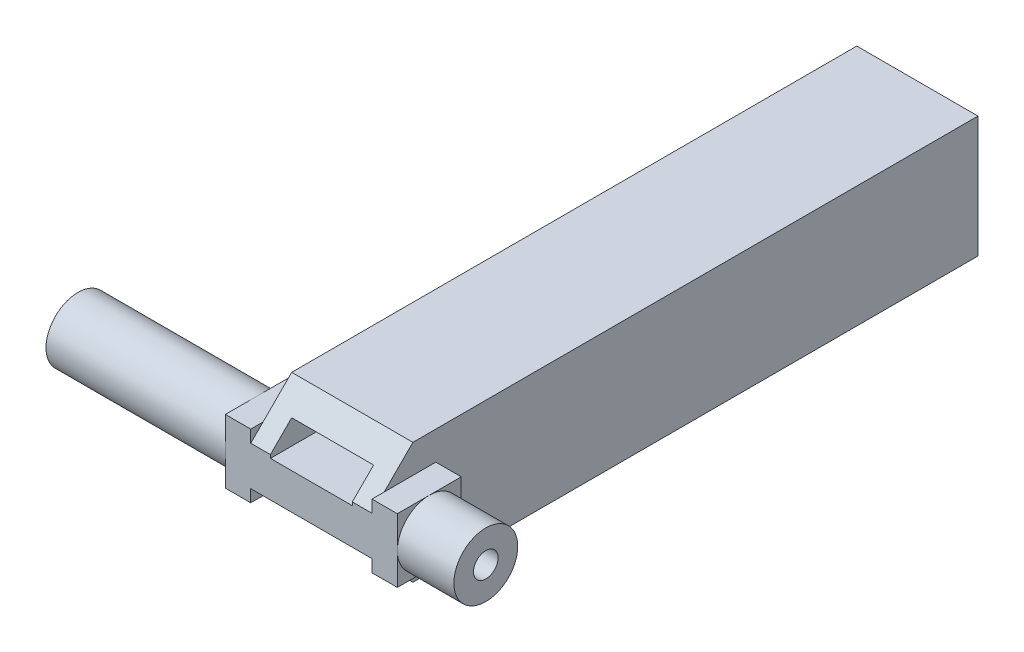
ISO-10303-21;
HEADER;
FILE_DESCRIPTION(('STEP AP214'),'2;1');
FILE_NAME('part.step','',(''),(''),'','','');
FILE_SCHEMA(('AUTOMOTIVE_DESIGN { 1 0 10303 214 1 1 1 1 }'));
ENDSEC;
DATA;
#1=APPLICATION_CONTEXT('core data for automotive mechanical design processes');
#2=APPLICATION_PROTOCOL_DEFINITION('international standard','automotive_design',2000,#1);
#3=PRODUCT_CONTEXT('',#1,'mechanical');
#4=PRODUCT('Part','Part','',(#3));
#5=PRODUCT_RELATED_PRODUCT_CATEGORY('part','',(#4));
#6=PRODUCT_DEFINITION_FORMATION('','',#4);
#7=PRODUCT_DEFINITION_CONTEXT('part definition',#1,'design');
#8=PRODUCT_DEFINITION('design','',#6,#7);
#9=PRODUCT_DEFINITION_SHAPE('','',#8);
#10=(LENGTH_UNIT() NAMED_UNIT(*) SI_UNIT(.MILLI.,.METRE.));
#11=(NAMED_UNIT(*) PLANE_ANGLE_UNIT() SI_UNIT($,.RADIAN.));
#12=(NAMED_UNIT(*) SI_UNIT($,.STERADIAN.) SOLID_ANGLE_UNIT());
#13=UNCERTAINTY_MEASURE_WITH_UNIT(LENGTH_MEASURE(1.E-05),#10,'distance_accuracy_value','');
#14=(GEOMETRIC_REPRESENTATION_CONTEXT(3) GLOBAL_UNCERTAINTY_ASSIGNED_CONTEXT((#13)) GLOBAL_UNIT_ASSIGNED_CONTEXT((#10,
#11,#12)) REPRESENTATION_CONTEXT('',''));
#15=CARTESIAN_POINT('',(0.,0.,0.));
#16=DIRECTION('',(0.,0.,1.));
#17=DIRECTION('',(1.,0.,0.));
#18=AXIS2_PLACEMENT_3D('',#15,#16,#17);
#19=CARTESIAN_POINT('',(14.8,0.,0.));
#20=DIRECTION('',(1.,0.,0.));
#21=DIRECTION('',(0.,0.,-1.));
#22=AXIS2_PLACEMENT_3D('',#19,#20,#21);
#23=PLANE('',#22);
#24=DIRECTION('',(0.,0.707106781186546,-0.707106781186549));
#25=VECTOR('',#24,1.);
#26=CARTESIAN_POINT('',(14.8,19.7,19.6999999999999));
#27=LINE('',#26,#25);
#28=CARTESIAN_POINT('',(14.8,7.4,32.));
#29=VERTEX_POINT('',#28);
#30=CARTESIAN_POINT('',(14.8,3.9,35.5));
#31=VERTEX_POINT('',#30);
#32=EDGE_CURVE('E462',#29,#31,#27,.F.);
#33=ORIENTED_EDGE('',*,*,#32,.T.);
#34=DIRECTION('',(0.,0.,1.));
#35=VECTOR('',#34,1.);
#36=CARTESIAN_POINT('',(14.8,3.89999999999999,37.));
#37=LINE('',#36,#35);
#38=CARTESIAN_POINT('',(14.8,3.89999999999999,29.2));
#39=VERTEX_POINT('',#38);
#40=EDGE_CURVE('E285',#39,#31,#37,.T.);
#41=ORIENTED_EDGE('',*,*,#40,.F.);
#42=DIRECTION('',(0.,1.,0.));
#43=VECTOR('',#42,1.);
#44=CARTESIAN_POINT('',(14.8,-3.9,29.2));
#45=LINE('',#44,#43);
#46=CARTESIAN_POINT('',(14.8,-3.9,29.2));
#47=VERTEX_POINT('',#46);
#48=EDGE_CURVE('E262',#47,#39,#45,.T.);
#49=ORIENTED_EDGE('',*,*,#48,.F.);
#50=DIRECTION('',(0.,0.,-1.));
#51=VECTOR('',#50,1.);
#52=CARTESIAN_POINT('',(14.8,-3.9,37.));
#53=LINE('',#52,#51);
#54=CARTESIAN_POINT('',(14.8,-3.9,35.5));
#55=VERTEX_POINT('',#54);
#56=EDGE_CURVE('E288',#55,#47,#53,.T.);
#57=ORIENTED_EDGE('',*,*,#56,.F.);
#58=DIRECTION('',(0.,0.70710678118655,0.707106781186545));
#59=VECTOR('',#58,1.);
#60=CARTESIAN_POINT('',(14.8,-19.7,19.7000000000001));
#61=LINE('',#60,#59);
#62=CARTESIAN_POINT('',(14.8,-7.4,32.));
#63=VERTEX_POINT('',#62);
#64=EDGE_CURVE('E465',#55,#63,#61,.F.);
#65=ORIENTED_EDGE('',*,*,#64,.T.);
#66=DIRECTION('',(0.,0.,-1.));
#67=VECTOR('',#66,1.);
#68=CARTESIAN_POINT('',(14.8,-7.4,-37.));
#69=LINE('',#68,#67);
#70=CARTESIAN_POINT('',(14.8,-7.4,-37.));
#71=VERTEX_POINT('',#70);
#72=EDGE_CURVE('E429',#63,#71,#69,.T.);
#73=ORIENTED_EDGE('',*,*,#72,.T.);
#74=DIRECTION('',(0.,1.,0.));
#75=VECTOR('',#74,1.);
#76=CARTESIAN_POINT('',(14.8,-7.4,-37.));
#77=LINE('',#76,#75);
#78=CARTESIAN_POINT('',(14.8,7.40000000000001,-37.));
#79=VERTEX_POINT('',#78);
#80=EDGE_CURVE('E431',#71,#79,#77,.T.);
#81=ORIENTED_EDGE('',*,*,#80,.T.);
#82=DIRECTION('',(0.,0.,1.));
#83=VECTOR('',#82,1.);
#84=CARTESIAN_POINT('',(14.8,7.40000000000001,-37.));
#85=LINE('',#84,#83);
#86=EDGE_CURVE('E434',#79,#29,#85,.T.);
#87=ORIENTED_EDGE('',*,*,#86,.T.);
#88=EDGE_LOOP('',(#33,#41,#49,#57,#65,#73,#81,#87));
#89=FACE_BOUND('',#88,.T.);
#90=ADVANCED_FACE('F34',(#89),#23,.T.);
#91=CARTESIAN_POINT('',(0.,0.,0.));
#92=DIRECTION('',(1.,0.,0.));
#93=DIRECTION('',(0.,0.,-1.));
#94=AXIS2_PLACEMENT_3D('',#91,#92,#93);
#95=PLANE('',#94);
#96=DIRECTION('',(0.,0.,1.));
#97=VECTOR('',#96,1.);
#98=CARTESIAN_POINT('',(0.,-3.89999999999999,37.));
#99=LINE('',#98,#97);
#100=CARTESIAN_POINT('',(0.,-3.89999999999999,29.2));
#101=VERTEX_POINT('',#100);
#102=CARTESIAN_POINT('',(0.,-3.89999999999999,35.5));
#103=VERTEX_POINT('',#102);
#104=EDGE_CURVE('E334',#101,#103,#99,.T.);
#105=ORIENTED_EDGE('',*,*,#104,.F.);
#106=DIRECTION('',(0.,-1.,0.));
#107=VECTOR('',#106,1.);
#108=CARTESIAN_POINT('',(0.,-3.89999999999999,29.2));
#109=LINE('',#108,#107);
#110=CARTESIAN_POINT('',(0.,3.89999999999999,29.2));
#111=VERTEX_POINT('',#110);
#112=EDGE_CURVE('E329',#111,#101,#109,.T.);
#113=ORIENTED_EDGE('',*,*,#112,.F.);
#114=DIRECTION('',(0.,0.,-1.));
#115=VECTOR('',#114,1.);
#116=CARTESIAN_POINT('',(0.,3.89999999999999,37.));
#117=LINE('',#116,#115);
#118=CARTESIAN_POINT('',(0.,3.89999999999999,35.5));
#119=VERTEX_POINT('',#118);
#120=EDGE_CURVE('E338',#119,#111,#117,.T.);
#121=ORIENTED_EDGE('',*,*,#120,.F.);
#122=DIRECTION('',(0.,-0.707106781186546,0.707106781186549));
#123=VECTOR('',#122,1.);
#124=CARTESIAN_POINT('',(0.,2.39999999999999,37.));
#125=LINE('',#124,#123);
#126=CARTESIAN_POINT('',(0.,7.4,32.));
#127=VERTEX_POINT('',#126);
#128=EDGE_CURVE('E451',#119,#127,#125,.F.);
#129=ORIENTED_EDGE('',*,*,#128,.T.);
#130=DIRECTION('',(0.,0.,1.));
#131=VECTOR('',#130,1.);
#132=CARTESIAN_POINT('',(0.,7.40000000000001,-37.));
#133=LINE('',#132,#131);
#134=CARTESIAN_POINT('',(0.,7.40000000000001,-37.));
#135=VERTEX_POINT('',#134);
#136=EDGE_CURVE('E432',#135,#127,#133,.T.);
#137=ORIENTED_EDGE('',*,*,#136,.F.);
#138=DIRECTION('',(0.,1.,0.));
#139=VECTOR('',#138,1.);
#140=CARTESIAN_POINT('',(0.,-7.4,-37.));
#141=LINE('',#140,#139);
#142=CARTESIAN_POINT('',(0.,-7.4,-37.));
#143=VERTEX_POINT('',#142);
#144=EDGE_CURVE('E439',#143,#135,#141,.T.);
#145=ORIENTED_EDGE('',*,*,#144,.F.);
#146=DIRECTION('',(0.,0.,-1.));
#147=VECTOR('',#146,1.);
#148=CARTESIAN_POINT('',(0.,-7.4,-37.));
#149=LINE('',#148,#147);
#150=CARTESIAN_POINT('',(0.,-7.4,32.));
#151=VERTEX_POINT('',#150);
#152=EDGE_CURVE('E423',#151,#143,#149,.T.);
#153=ORIENTED_EDGE('',*,*,#152,.F.);
#154=DIRECTION('',(0.,-0.70710678118655,-0.707106781186545));
#155=VECTOR('',#154,1.);
#156=CARTESIAN_POINT('',(0.,-7.4,32.));
#157=LINE('',#156,#155);
#158=EDGE_CURVE('E455',#151,#103,#157,.F.);
#159=ORIENTED_EDGE('',*,*,#158,.T.);
#160=EDGE_LOOP('',(#105,#113,#121,#129,#137,#145,#153,#159));
#161=FACE_BOUND('',#160,.T.);
#162=ADVANCED_FACE('F503',(#161),#95,.F.);
#163=CARTESIAN_POINT('',(14.8,-7.4,37.));
#164=DIRECTION('',(0.,0.,-1.));
#165=DIRECTION('',(-1.,0.,0.));
#166=AXIS2_PLACEMENT_3D('',#163,#164,#165);
#167=PLANE('',#166);
#168=DIRECTION('',(-1.,0.,0.));
#169=VECTOR('',#168,1.);
#170=CARTESIAN_POINT('',(14.8,2.39999999999999,37.));
#171=LINE('',#170,#169);
#172=CARTESIAN_POINT('',(14.8,2.39999999999999,37.));
#173=VERTEX_POINT('',#172);
#174=CARTESIAN_POINT('',(12.4,2.39999999999999,37.));
#175=VERTEX_POINT('',#174);
#176=EDGE_CURVE('E256',#173,#175,#171,.T.);
#177=ORIENTED_EDGE('',*,*,#176,.T.);
#178=DIRECTION('',(0.,-1.,0.));
#179=VECTOR('',#178,1.);
#180=CARTESIAN_POINT('',(12.4,2.,37.));
#181=LINE('',#180,#179);
#182=CARTESIAN_POINT('',(12.4,2.,37.));
#183=VERTEX_POINT('',#182);
#184=EDGE_CURVE('E239',#175,#183,#181,.T.);
#185=ORIENTED_EDGE('',*,*,#184,.T.);
#186=DIRECTION('',(-1.,0.,0.));
#187=VECTOR('',#186,1.);
#188=CARTESIAN_POINT('',(2.4,2.,37.));
#189=LINE('',#188,#187);
#190=CARTESIAN_POINT('',(2.4,2.,37.));
#191=VERTEX_POINT('',#190);
#192=EDGE_CURVE('E247',#183,#191,#189,.T.);
#193=ORIENTED_EDGE('',*,*,#192,.T.);
#194=DIRECTION('',(0.,1.,0.));
#195=VECTOR('',#194,1.);
#196=CARTESIAN_POINT('',(2.4,2.,37.));
#197=LINE('',#196,#195);
#198=CARTESIAN_POINT('',(2.4,2.39999999999999,37.));
#199=VERTEX_POINT('',#198);
#200=EDGE_CURVE('E244',#191,#199,#197,.T.);
#201=ORIENTED_EDGE('',*,*,#200,.T.);
#202=CARTESIAN_POINT('',(0.,2.39999999999999,37.));
#203=VERTEX_POINT('',#202);
#204=EDGE_CURVE('E458',#199,#203,#171,.T.);
#205=ORIENTED_EDGE('',*,*,#204,.T.);
#206=DIRECTION('',(0.,1.,0.));
#207=VECTOR('',#206,1.);
#208=CARTESIAN_POINT('',(0.,-3.89999999999999,37.));
#209=LINE('',#208,#207);
#210=CARTESIAN_POINT('',(0.,3.89999999999999,37.));
#211=VERTEX_POINT('',#210);
#212=EDGE_CURVE('E339',#203,#211,#209,.T.);
#213=ORIENTED_EDGE('',*,*,#212,.T.);
#214=DIRECTION('',(1.,0.,0.));
#215=VECTOR('',#214,1.);
#216=CARTESIAN_POINT('',(-3.1,3.89999999999999,37.));
#217=LINE('',#216,#215);
#218=CARTESIAN_POINT('',(-3.1,3.89999999999999,37.));
#219=VERTEX_POINT('',#218);
#220=EDGE_CURVE('E345',#219,#211,#217,.T.);
#221=ORIENTED_EDGE('',*,*,#220,.F.);
#222=DIRECTION('',(0.,1.,0.));
#223=VECTOR('',#222,1.);
#224=CARTESIAN_POINT('',(-3.1,-3.89999999999999,37.));
#225=LINE('',#224,#223);
#226=CARTESIAN_POINT('',(-3.1,0.,37.));
#227=VERTEX_POINT('',#226);
#228=EDGE_CURVE('E321',#227,#219,#225,.T.);
#229=ORIENTED_EDGE('',*,*,#228,.F.);
#230=CARTESIAN_POINT('',(-3.1,-3.89999999999999,37.));
#231=VERTEX_POINT('',#230);
#232=EDGE_CURVE('E322',#231,#227,#225,.T.);
#233=ORIENTED_EDGE('',*,*,#232,.F.);
#234=DIRECTION('',(1.,0.,0.));
#235=VECTOR('',#234,1.);
#236=CARTESIAN_POINT('',(-3.1,-3.89999999999999,37.));
#237=LINE('',#236,#235);
#238=CARTESIAN_POINT('',(0.,-3.89999999999999,37.));
#239=VERTEX_POINT('',#238);
#240=EDGE_CURVE('E348',#231,#239,#237,.T.);
#241=ORIENTED_EDGE('',*,*,#240,.T.);
#242=CARTESIAN_POINT('',(0.,-2.4,37.));
#243=VERTEX_POINT('',#242);
#244=EDGE_CURVE('E335',#239,#243,#209,.T.);
#245=ORIENTED_EDGE('',*,*,#244,.T.);
#246=DIRECTION('',(1.,0.,0.));
#247=VECTOR('',#246,1.);
#248=CARTESIAN_POINT('',(14.8,-2.4,37.));
#249=LINE('',#248,#247);
#250=CARTESIAN_POINT('',(14.8,-2.4,37.));
#251=VERTEX_POINT('',#250);
#252=EDGE_CURVE('E460',#243,#251,#249,.T.);
#253=ORIENTED_EDGE('',*,*,#252,.T.);
#254=DIRECTION('',(0.,-1.,0.));
#255=VECTOR('',#254,1.);
#256=CARTESIAN_POINT('',(14.8,-3.9,37.));
#257=LINE('',#256,#255);
#258=CARTESIAN_POINT('',(14.8,-3.9,37.));
#259=VERTEX_POINT('',#258);
#260=EDGE_CURVE('E289',#251,#259,#257,.T.);
#261=ORIENTED_EDGE('',*,*,#260,.T.);
#262=DIRECTION('',(-1.,0.,0.));
#263=VECTOR('',#262,1.);
#264=CARTESIAN_POINT('',(17.9,-3.9,37.));
#265=LINE('',#264,#263);
#266=CARTESIAN_POINT('',(17.9,-3.9,37.));
#267=VERTEX_POINT('',#266);
#268=EDGE_CURVE('E295',#267,#259,#265,.T.);
#269=ORIENTED_EDGE('',*,*,#268,.F.);
#270=DIRECTION('',(0.,-1.,0.));
#271=VECTOR('',#270,1.);
#272=CARTESIAN_POINT('',(17.9,-3.9,37.));
#273=LINE('',#272,#271);
#274=CARTESIAN_POINT('',(17.9,0.,37.));
#275=VERTEX_POINT('',#274);
#276=EDGE_CURVE('E272',#275,#267,#273,.T.);
#277=ORIENTED_EDGE('',*,*,#276,.F.);
#278=CARTESIAN_POINT('',(17.9,3.89999999999999,37.));
#279=VERTEX_POINT('',#278);
#280=EDGE_CURVE('E273',#279,#275,#273,.T.);
#281=ORIENTED_EDGE('',*,*,#280,.F.);
#282=DIRECTION('',(-1.,0.,0.));
#283=VECTOR('',#282,1.);
#284=CARTESIAN_POINT('',(17.9,3.89999999999999,37.));
#285=LINE('',#284,#283);
#286=CARTESIAN_POINT('',(14.8,3.89999999999999,37.));
#287=VERTEX_POINT('',#286);
#288=EDGE_CURVE('E298',#279,#287,#285,.T.);
#289=ORIENTED_EDGE('',*,*,#288,.T.);
#290=EDGE_CURVE('E286',#287,#173,#257,.T.);
#291=ORIENTED_EDGE('',*,*,#290,.T.);
#292=EDGE_LOOP('',(#177,#185,#193,#201,#205,#213,#221,#229,#233,#241,#245,#253,#261,#269,#277,
#281,#289,#291));
#293=FACE_BOUND('',#292,.T.);
#294=ADVANCED_FACE('F254',(#293),#167,.F.);
#295=CARTESIAN_POINT('',(14.8,-7.4,-37.));
#296=DIRECTION('',(0.,1.,0.));
#297=DIRECTION('',(0.,0.,1.));
#298=AXIS2_PLACEMENT_3D('',#295,#296,#297);
#299=PLANE('',#298);
#300=ORIENTED_EDGE('',*,*,#72,.F.);
#301=DIRECTION('',(-1.,0.,0.));
#302=VECTOR('',#301,1.);
#303=CARTESIAN_POINT('',(14.8,-7.4,32.));
#304=LINE('',#303,#302);
#305=EDGE_CURVE('E448',#63,#151,#304,.T.);
#306=ORIENTED_EDGE('',*,*,#305,.T.);
#307=ORIENTED_EDGE('',*,*,#152,.T.);
#308=DIRECTION('',(-1.,0.,0.));
#309=VECTOR('',#308,1.);
#310=CARTESIAN_POINT('',(14.8,-7.4,-37.));
#311=LINE('',#310,#309);
#312=EDGE_CURVE('E445',#71,#143,#311,.T.);
#313=ORIENTED_EDGE('',*,*,#312,.F.);
#314=EDGE_LOOP('',(#300,#306,#307,#313));
#315=FACE_BOUND('',#314,.T.);
#316=ADVANCED_FACE('F554',(#315),#299,.F.);
#317=CARTESIAN_POINT('',(14.8,-7.4,-37.));
#318=DIRECTION('',(0.,0.,1.));
#319=DIRECTION('',(1.,0.,0.));
#320=AXIS2_PLACEMENT_3D('',#317,#318,#319);
#321=PLANE('',#320);
#322=DIRECTION('',(-1.,0.,0.));
#323=VECTOR('',#322,1.);
#324=CARTESIAN_POINT('',(2.4,-5.,-37.));
#325=LINE('',#324,#323);
#326=CARTESIAN_POINT('',(12.4,-5.,-37.));
#327=VERTEX_POINT('',#326);
#328=CARTESIAN_POINT('',(2.4,-5.,-37.));
#329=VERTEX_POINT('',#328);
#330=EDGE_CURVE('E414',#327,#329,#325,.T.);
#331=ORIENTED_EDGE('',*,*,#330,.F.);
#332=DIRECTION('',(0.,-1.,0.));
#333=VECTOR('',#332,1.);
#334=CARTESIAN_POINT('',(12.4,-5.,-37.));
#335=LINE('',#334,#333);
#336=CARTESIAN_POINT('',(12.4,5.,-37.));
#337=VERTEX_POINT('',#336);
#338=EDGE_CURVE('E403',#337,#327,#335,.T.);
#339=ORIENTED_EDGE('',*,*,#338,.F.);
#340=DIRECTION('',(1.,0.,0.));
#341=VECTOR('',#340,1.);
#342=CARTESIAN_POINT('',(2.4,5.,-37.));
#343=LINE('',#342,#341);
#344=CARTESIAN_POINT('',(2.4,5.,-37.));
#345=VERTEX_POINT('',#344);
#346=EDGE_CURVE('E406',#345,#337,#343,.T.);
#347=ORIENTED_EDGE('',*,*,#346,.F.);
#348=DIRECTION('',(0.,1.,0.));
#349=VECTOR('',#348,1.);
#350=CARTESIAN_POINT('',(2.4,-5.,-37.));
#351=LINE('',#350,#349);
#352=EDGE_CURVE('E417',#329,#345,#351,.T.);
#353=ORIENTED_EDGE('',*,*,#352,.F.);
#354=EDGE_LOOP('',(#331,#339,#347,#353));
#355=FACE_BOUND('',#354,.T.);
#356=ORIENTED_EDGE('',*,*,#144,.T.);
#357=DIRECTION('',(-1.,0.,0.));
#358=VECTOR('',#357,1.);
#359=CARTESIAN_POINT('',(14.8,7.40000000000001,-37.));
#360=LINE('',#359,#358);
#361=EDGE_CURVE('E437',#79,#135,#360,.T.);
#362=ORIENTED_EDGE('',*,*,#361,.F.);
#363=ORIENTED_EDGE('',*,*,#80,.F.);
#364=ORIENTED_EDGE('',*,*,#312,.T.);
#365=EDGE_LOOP('',(#356,#362,#363,#364));
#366=FACE_BOUND('',#365,.T.);
#367=ADVANCED_FACE('F557',(#355,#366),#321,.F.);
#368=CARTESIAN_POINT('',(14.8,7.40000000000001,-37.));
#369=DIRECTION('',(0.,-1.,0.));
#370=DIRECTION('',(0.,0.,-1.));
#371=AXIS2_PLACEMENT_3D('',#368,#369,#370);
#372=PLANE('',#371);
#373=ORIENTED_EDGE('',*,*,#136,.T.);
#374=DIRECTION('',(1.,0.,0.));
#375=VECTOR('',#374,1.);
#376=CARTESIAN_POINT('',(14.8,7.4,32.));
#377=LINE('',#376,#375);
#378=EDGE_CURVE('E469',#127,#29,#377,.T.);
#379=ORIENTED_EDGE('',*,*,#378,.T.);
#380=ORIENTED_EDGE('',*,*,#86,.F.);
#381=ORIENTED_EDGE('',*,*,#361,.T.);
#382=EDGE_LOOP('',(#373,#379,#380,#381));
#383=FACE_BOUND('',#382,.T.);
#384=ADVANCED_FACE('F518',(#383),#372,.F.);
#385=CARTESIAN_POINT('',(12.4,-5.,28.));
#386=DIRECTION('',(1.,0.,0.));
#387=DIRECTION('',(0.,0.,-1.));
#388=AXIS2_PLACEMENT_3D('',#385,#386,#387);
#389=PLANE('',#388);
#390=ORIENTED_EDGE('',*,*,#338,.T.);
#391=DIRECTION('',(0.,0.,-1.));
#392=VECTOR('',#391,1.);
#393=CARTESIAN_POINT('',(12.4,-5.,28.));
#394=LINE('',#393,#392);
#395=CARTESIAN_POINT('',(12.4,-5.,28.));
#396=VERTEX_POINT('',#395);
#397=EDGE_CURVE('E412',#396,#327,#394,.T.);
#398=ORIENTED_EDGE('',*,*,#397,.F.);
#399=DIRECTION('',(0.,-1.,0.));
#400=VECTOR('',#399,1.);
#401=CARTESIAN_POINT('',(12.4,-5.,28.));
#402=LINE('',#401,#400);
#403=CARTESIAN_POINT('',(12.4,2.,28.));
#404=VERTEX_POINT('',#403);
#405=EDGE_CURVE('E242',#404,#396,#402,.T.);
#406=ORIENTED_EDGE('',*,*,#405,.F.);
#407=DIRECTION('',(0.,0.,-1.));
#408=VECTOR('',#407,1.);
#409=CARTESIAN_POINT('',(12.4,2.,37.));
#410=LINE('',#409,#408);
#411=EDGE_CURVE('E49',#183,#404,#410,.T.);
#412=ORIENTED_EDGE('',*,*,#411,.F.);
#413=ORIENTED_EDGE('',*,*,#184,.F.);
#414=DIRECTION('',(0.,-0.707106781186546,0.707106781186549));
#415=VECTOR('',#414,1.);
#416=CARTESIAN_POINT('',(12.4,2.39999999999999,37.));
#417=LINE('',#416,#415);
#418=CARTESIAN_POINT('',(12.4,5.,34.4));
#419=VERTEX_POINT('',#418);
#420=EDGE_CURVE('E11',#175,#419,#417,.F.);
#421=ORIENTED_EDGE('',*,*,#420,.T.);
#422=DIRECTION('',(0.,0.,-1.));
#423=VECTOR('',#422,1.);
#424=CARTESIAN_POINT('',(12.4,5.,28.));
#425=LINE('',#424,#423);
#426=EDGE_CURVE('E421',#419,#337,#425,.T.);
#427=ORIENTED_EDGE('',*,*,#426,.T.);
#428=EDGE_LOOP('',(#390,#398,#406,#412,#413,#421,#427));
#429=FACE_BOUND('',#428,.T.);
#430=ADVANCED_FACE('F237',(#429),#389,.F.);
#431=CARTESIAN_POINT('',(2.4,5.,28.));
#432=DIRECTION('',(0.,1.,0.));
#433=DIRECTION('',(-1.,0.,0.));
#434=AXIS2_PLACEMENT_3D('',#431,#432,#433);
#435=PLANE('',#434);
#436=ORIENTED_EDGE('',*,*,#346,.T.);
#437=ORIENTED_EDGE('',*,*,#426,.F.);
#438=DIRECTION('',(1.,0.,0.));
#439=VECTOR('',#438,1.);
#440=CARTESIAN_POINT('',(14.8,5.,34.4));
#441=LINE('',#440,#439);
#442=CARTESIAN_POINT('',(2.4,5.,34.4));
#443=VERTEX_POINT('',#442);
#444=EDGE_CURVE('E42',#419,#443,#441,.F.);
#445=ORIENTED_EDGE('',*,*,#444,.T.);
#446=DIRECTION('',(0.,0.,-1.));
#447=VECTOR('',#446,1.);
#448=CARTESIAN_POINT('',(2.4,5.,28.));
#449=LINE('',#448,#447);
#450=EDGE_CURVE('E57',#443,#345,#449,.T.);
#451=ORIENTED_EDGE('',*,*,#450,.T.);
#452=EDGE_LOOP('',(#436,#437,#445,#451));
#453=FACE_BOUND('',#452,.T.);
#454=ADVANCED_FACE('F482',(#453),#435,.F.);
#455=CARTESIAN_POINT('',(2.4,-5.,28.));
#456=DIRECTION('',(-1.,0.,0.));
#457=DIRECTION('',(0.,0.,1.));
#458=AXIS2_PLACEMENT_3D('',#455,#456,#457);
#459=PLANE('',#458);
#460=ORIENTED_EDGE('',*,*,#352,.T.);
#461=ORIENTED_EDGE('',*,*,#450,.F.);
#462=DIRECTION('',(0.,0.707106781186546,-0.707106781186549));
#463=VECTOR('',#462,1.);
#464=CARTESIAN_POINT('',(2.4,2.39999999999999,37.));
#465=LINE('',#464,#463);
#466=EDGE_CURVE('E478',#443,#199,#465,.F.);
#467=ORIENTED_EDGE('',*,*,#466,.T.);
#468=ORIENTED_EDGE('',*,*,#200,.F.);
#469=DIRECTION('',(0.,0.,-1.));
#470=VECTOR('',#469,1.);
#471=CARTESIAN_POINT('',(2.4,2.,37.));
#472=LINE('',#471,#470);
#473=CARTESIAN_POINT('',(2.4,2.,28.));
#474=VERTEX_POINT('',#473);
#475=EDGE_CURVE('E243',#191,#474,#472,.T.);
#476=ORIENTED_EDGE('',*,*,#475,.T.);
#477=DIRECTION('',(0.,1.,0.));
#478=VECTOR('',#477,1.);
#479=CARTESIAN_POINT('',(2.4,-5.,28.));
#480=LINE('',#479,#478);
#481=CARTESIAN_POINT('',(2.4,-5.,28.));
#482=VERTEX_POINT('',#481);
#483=EDGE_CURVE('E409',#482,#474,#480,.T.);
#484=ORIENTED_EDGE('',*,*,#483,.F.);
#485=DIRECTION('',(0.,0.,-1.));
#486=VECTOR('',#485,1.);
#487=CARTESIAN_POINT('',(2.4,-5.,28.));
#488=LINE('',#487,#486);
#489=EDGE_CURVE('E425',#482,#329,#488,.T.);
#490=ORIENTED_EDGE('',*,*,#489,.T.);
#491=EDGE_LOOP('',(#460,#461,#467,#468,#476,#484,#490));
#492=FACE_BOUND('',#491,.T.);
#493=ADVANCED_FACE('F486',(#492),#459,.F.);
#494=CARTESIAN_POINT('',(2.4,-5.,28.));
#495=DIRECTION('',(0.,-1.,0.));
#496=DIRECTION('',(1.,0.,0.));
#497=AXIS2_PLACEMENT_3D('',#494,#495,#496);
#498=PLANE('',#497);
#499=ORIENTED_EDGE('',*,*,#330,.T.);
#500=ORIENTED_EDGE('',*,*,#489,.F.);
#501=DIRECTION('',(-1.,0.,0.));
#502=VECTOR('',#501,1.);
#503=CARTESIAN_POINT('',(2.4,-5.,28.));
#504=LINE('',#503,#502);
#505=EDGE_CURVE('E405',#396,#482,#504,.T.);
#506=ORIENTED_EDGE('',*,*,#505,.F.);
#507=ORIENTED_EDGE('',*,*,#397,.T.);
#508=EDGE_LOOP('',(#499,#500,#506,#507));
#509=FACE_BOUND('',#508,.T.);
#510=ADVANCED_FACE('F577',(#509),#498,.F.);
#511=CARTESIAN_POINT('',(0.,0.,28.));
#512=DIRECTION('',(0.,0.,-1.));
#513=DIRECTION('',(-1.,0.,0.));
#514=AXIS2_PLACEMENT_3D('',#511,#512,#513);
#515=PLANE('',#514);
#516=DIRECTION('',(-1.,0.,0.));
#517=VECTOR('',#516,1.);
#518=CARTESIAN_POINT('',(2.4,2.,28.));
#519=LINE('',#518,#517);
#520=EDGE_CURVE('E257',#404,#474,#519,.T.);
#521=ORIENTED_EDGE('',*,*,#520,.F.);
#522=ORIENTED_EDGE('',*,*,#405,.T.);
#523=ORIENTED_EDGE('',*,*,#505,.T.);
#524=ORIENTED_EDGE('',*,*,#483,.T.);
#525=EDGE_LOOP('',(#521,#522,#523,#524));
#526=FACE_BOUND('',#525,.T.);
#527=ADVANCED_FACE('F580',(#526),#515,.T.);
#528=CARTESIAN_POINT('',(-25.,0.,33.1));
#529=DIRECTION('',(1.,0.,0.));
#530=DIRECTION('',(0.,0.,-1.));
#531=AXIS2_PLACEMENT_3D('',#528,#529,#530);
#532=CYLINDRICAL_SURFACE('',#531,3.9);
#533=CARTESIAN_POINT('',(-25.,0.,33.1));
#534=DIRECTION('',(-1.,0.,0.));
#535=DIRECTION('',(0.,0.,1.));
#536=AXIS2_PLACEMENT_3D('',#533,#534,#535);
#537=CIRCLE('',#536,3.9);
#538=CARTESIAN_POINT('',(-25.,0.,37.));
#539=VERTEX_POINT('',#538);
#540=EDGE_CURVE('E391',#539,#539,#537,.T.);
#541=ORIENTED_EDGE('',*,*,#540,.F.);
#542=EDGE_LOOP('',(#541));
#543=FACE_BOUND('',#542,.T.);
#544=CARTESIAN_POINT('',(-3.1,0.,33.1));
#545=DIRECTION('',(-1.,0.,0.));
#546=DIRECTION('',(0.,0.,1.));
#547=AXIS2_PLACEMENT_3D('',#544,#545,#546);
#548=CIRCLE('',#547,3.9);
#549=CARTESIAN_POINT('',(-3.1,-3.89999999999999,33.1));
#550=VERTEX_POINT('',#549);
#551=EDGE_CURVE('E356',#550,#227,#548,.T.);
#552=ORIENTED_EDGE('',*,*,#551,.T.);
#553=CARTESIAN_POINT('',(-3.1,3.89999999999999,33.1));
#554=VERTEX_POINT('',#553);
#555=EDGE_CURVE('E360',#227,#554,#548,.T.);
#556=ORIENTED_EDGE('',*,*,#555,.T.);
#557=CARTESIAN_POINT('',(-3.1,0.,29.2));
#558=VERTEX_POINT('',#557);
#559=EDGE_CURVE('E915',#554,#558,#548,.T.);
#560=ORIENTED_EDGE('',*,*,#559,.T.);
#561=EDGE_CURVE('E359',#558,#550,#548,.T.);
#562=ORIENTED_EDGE('',*,*,#561,.T.);
#563=EDGE_LOOP('',(#552,#556,#560,#562));
#564=FACE_BOUND('',#563,.T.);
#565=ADVANCED_FACE('F588',(#543,#564),#532,.T.);
#566=CARTESIAN_POINT('',(-25.,0.,33.1));
#567=DIRECTION('',(-1.,0.,0.));
#568=DIRECTION('',(0.,0.,1.));
#569=AXIS2_PLACEMENT_3D('',#566,#567,#568);
#570=PLANE('',#569);
#571=DIRECTION('',(0.,-0.930737046320651,0.365689144775055));
#572=VECTOR('',#571,1.);
#573=CARTESIAN_POINT('',(-25.,-3.65323204762164,32.2790885515293));
#574=LINE('',#573,#572);
#575=CARTESIAN_POINT('',(-25.,2.11733763956639,30.011815853924));
#576=VERTEX_POINT('',#575);
#577=CARTESIAN_POINT('',(-25.,-3.65323204762164,32.2790885515293));
#578=VERTEX_POINT('',#577);
#579=EDGE_CURVE('E379',#576,#578,#574,.T.);
#580=ORIENTED_EDGE('',*,*,#579,.F.);
#581=DIRECTION('',(0.,-0.365689144775055,-0.930737046320651));
#582=VECTOR('',#581,1.);
#583=CARTESIAN_POINT('',(-25.,2.11733763956639,30.011815853924));
#584=LINE('',#583,#582);
#585=CARTESIAN_POINT('',(-25.,3.65323204762163,33.9209114484707));
#586=VERTEX_POINT('',#585);
#587=EDGE_CURVE('E369',#586,#576,#584,.T.);
#588=ORIENTED_EDGE('',*,*,#587,.F.);
#589=DIRECTION('',(0.,0.930737046320651,-0.365689144775054));
#590=VECTOR('',#589,1.);
#591=CARTESIAN_POINT('',(-25.,3.65323204762163,33.9209114484707));
#592=LINE('',#591,#590);
#593=CARTESIAN_POINT('',(-25.,-2.11733763956641,36.188184146076));
#594=VERTEX_POINT('',#593);
#595=EDGE_CURVE('E384',#594,#586,#592,.T.);
#596=ORIENTED_EDGE('',*,*,#595,.F.);
#597=DIRECTION('',(0.,0.365689144775055,0.930737046320651));
#598=VECTOR('',#597,1.);
#599=CARTESIAN_POINT('',(-25.,-2.11733763956641,36.188184146076));
#600=LINE('',#599,#598);
#601=EDGE_CURVE('E381',#578,#594,#600,.T.);
#602=ORIENTED_EDGE('',*,*,#601,.F.);
#603=EDGE_LOOP('',(#580,#588,#596,#602));
#604=FACE_BOUND('',#603,.T.);
#605=ORIENTED_EDGE('',*,*,#540,.T.);
#606=EDGE_LOOP('',(#605));
#607=FACE_BOUND('',#606,.T.);
#608=ADVANCED_FACE('F601',(#604,#607),#570,.T.);
#609=CARTESIAN_POINT('',(14.8,-7.4,32.));
#610=DIRECTION('',(0.,0.707106781186545,-0.70710678118655));
#611=DIRECTION('',(-1.,0.,0.));
#612=AXIS2_PLACEMENT_3D('',#609,#610,#611);
#613=PLANE('',#612);
#614=EDGE_CURVE('E466',#251,#55,#61,.F.);
#615=ORIENTED_EDGE('',*,*,#614,.F.);
#616=ORIENTED_EDGE('',*,*,#252,.F.);
#617=DIRECTION('',(0.,0.70710678118655,0.707106781186545));
#618=VECTOR('',#617,1.);
#619=CARTESIAN_POINT('',(0.,-7.4,32.));
#620=LINE('',#619,#618);
#621=EDGE_CURVE('E354',#243,#103,#620,.F.);
#622=ORIENTED_EDGE('',*,*,#621,.T.);
#623=ORIENTED_EDGE('',*,*,#158,.F.);
#624=ORIENTED_EDGE('',*,*,#305,.F.);
#625=ORIENTED_EDGE('',*,*,#64,.F.);
#626=EDGE_LOOP('',(#615,#616,#622,#623,#624,#625));
#627=FACE_BOUND('',#626,.T.);
#628=ADVANCED_FACE('F548',(#627),#613,.F.);
#629=CARTESIAN_POINT('',(14.8,2.39999999999999,37.));
#630=DIRECTION('',(0.,-0.707106781186549,-0.707106781186546));
#631=DIRECTION('',(-1.,0.,0.));
#632=AXIS2_PLACEMENT_3D('',#629,#630,#631);
#633=PLANE('',#632);
#634=ORIENTED_EDGE('',*,*,#420,.F.);
#635=ORIENTED_EDGE('',*,*,#176,.F.);
#636=DIRECTION('',(0.,0.707106781186546,-0.707106781186549));
#637=VECTOR('',#636,1.);
#638=CARTESIAN_POINT('',(14.8,2.39999999999999,37.));
#639=LINE('',#638,#637);
#640=EDGE_CURVE('E305',#31,#173,#639,.F.);
#641=ORIENTED_EDGE('',*,*,#640,.F.);
#642=ORIENTED_EDGE('',*,*,#32,.F.);
#643=ORIENTED_EDGE('',*,*,#378,.F.);
#644=ORIENTED_EDGE('',*,*,#128,.F.);
#645=EDGE_CURVE('E452',#203,#119,#125,.F.);
#646=ORIENTED_EDGE('',*,*,#645,.F.);
#647=ORIENTED_EDGE('',*,*,#204,.F.);
#648=ORIENTED_EDGE('',*,*,#466,.F.);
#649=ORIENTED_EDGE('',*,*,#444,.F.);
#650=EDGE_LOOP('',(#634,#635,#641,#642,#643,#644,#646,#647,#648,#649));
#651=FACE_BOUND('',#650,.T.);
#652=ADVANCED_FACE('F36',(#651),#633,.F.);
#653=CARTESIAN_POINT('',(-19.,-3.65323204762164,32.2790885515293));
#654=DIRECTION('',(0.,-0.365689144775055,-0.930737046320651));
#655=DIRECTION('',(0.,0.930737046320651,-0.365689144775055));
#656=AXIS2_PLACEMENT_3D('',#653,#654,#655);
#657=PLANE('',#656);
#658=ORIENTED_EDGE('',*,*,#579,.T.);
#659=DIRECTION('',(-1.,0.,0.));
#660=VECTOR('',#659,1.);
#661=CARTESIAN_POINT('',(-19.,-3.65323204762164,32.2790885515293));
#662=LINE('',#661,#660);
#663=CARTESIAN_POINT('',(-19.,-3.65323204762164,32.2790885515293));
#664=VERTEX_POINT('',#663);
#665=EDGE_CURVE('E378',#664,#578,#662,.T.);
#666=ORIENTED_EDGE('',*,*,#665,.F.);
#667=DIRECTION('',(0.,-0.930737046320651,0.365689144775055));
#668=VECTOR('',#667,1.);
#669=CARTESIAN_POINT('',(-19.,-3.65323204762164,32.2790885515293));
#670=LINE('',#669,#668);
#671=CARTESIAN_POINT('',(-19.,2.11733763956639,30.011815853924));
#672=VERTEX_POINT('',#671);
#673=EDGE_CURVE('E365',#672,#664,#670,.T.);
#674=ORIENTED_EDGE('',*,*,#673,.F.);
#675=DIRECTION('',(-1.,0.,0.));
#676=VECTOR('',#675,1.);
#677=CARTESIAN_POINT('',(-19.,2.11733763956639,30.011815853924));
#678=LINE('',#677,#676);
#679=EDGE_CURVE('E389',#672,#576,#678,.T.);
#680=ORIENTED_EDGE('',*,*,#679,.T.);
#681=EDGE_LOOP('',(#658,#666,#674,#680));
#682=FACE_BOUND('',#681,.T.);
#683=ADVANCED_FACE('F606',(#682),#657,.F.);
#684=CARTESIAN_POINT('',(-19.,2.11733763956639,30.011815853924));
#685=DIRECTION('',(0.,0.93073704632065,-0.365689144775055));
#686=DIRECTION('',(0.,0.365689144775055,0.930737046320651));
#687=AXIS2_PLACEMENT_3D('',#684,#685,#686);
#688=PLANE('',#687);
#689=ORIENTED_EDGE('',*,*,#587,.T.);
#690=ORIENTED_EDGE('',*,*,#679,.F.);
#691=DIRECTION('',(0.,-0.365689144775055,-0.930737046320651));
#692=VECTOR('',#691,1.);
#693=CARTESIAN_POINT('',(-19.,2.11733763956639,30.011815853924));
#694=LINE('',#693,#692);
#695=CARTESIAN_POINT('',(-19.,3.65323204762163,33.9209114484707));
#696=VERTEX_POINT('',#695);
#697=EDGE_CURVE('E375',#696,#672,#694,.T.);
#698=ORIENTED_EDGE('',*,*,#697,.F.);
#699=DIRECTION('',(-1.,0.,0.));
#700=VECTOR('',#699,1.);
#701=CARTESIAN_POINT('',(-19.,3.65323204762163,33.9209114484707));
#702=LINE('',#701,#700);
#703=EDGE_CURVE('E392',#696,#586,#702,.T.);
#704=ORIENTED_EDGE('',*,*,#703,.T.);
#705=EDGE_LOOP('',(#689,#690,#698,#704));
#706=FACE_BOUND('',#705,.T.);
#707=ADVANCED_FACE('F609',(#706),#688,.F.);
#708=CARTESIAN_POINT('',(-19.,3.65323204762163,33.9209114484707));
#709=DIRECTION('',(0.,0.365689144775054,0.930737046320651));
#710=DIRECTION('',(0.,-0.930737046320651,0.365689144775054));
#711=AXIS2_PLACEMENT_3D('',#708,#709,#710);
#712=PLANE('',#711);
#713=ORIENTED_EDGE('',*,*,#595,.T.);
#714=ORIENTED_EDGE('',*,*,#703,.F.);
#715=DIRECTION('',(0.,0.930737046320651,-0.365689144775054));
#716=VECTOR('',#715,1.);
#717=CARTESIAN_POINT('',(-19.,3.65323204762163,33.9209114484707));
#718=LINE('',#717,#716);
#719=CARTESIAN_POINT('',(-19.,-2.11733763956641,36.188184146076));
#720=VERTEX_POINT('',#719);
#721=EDGE_CURVE('E372',#720,#696,#718,.T.);
#722=ORIENTED_EDGE('',*,*,#721,.F.);
#723=DIRECTION('',(-1.,0.,0.));
#724=VECTOR('',#723,1.);
#725=CARTESIAN_POINT('',(-19.,-2.11733763956641,36.188184146076));
#726=LINE('',#725,#724);
#727=EDGE_CURVE('E394',#720,#594,#726,.T.);
#728=ORIENTED_EDGE('',*,*,#727,.T.);
#729=EDGE_LOOP('',(#713,#714,#722,#728));
#730=FACE_BOUND('',#729,.T.);
#731=ADVANCED_FACE('F615',(#730),#712,.F.);
#732=CARTESIAN_POINT('',(-19.,-2.11733763956641,36.188184146076));
#733=DIRECTION('',(0.,-0.93073704632065,0.365689144775055));
#734=DIRECTION('',(0.,-0.365689144775055,-0.930737046320651));
#735=AXIS2_PLACEMENT_3D('',#732,#733,#734);
#736=PLANE('',#735);
#737=ORIENTED_EDGE('',*,*,#601,.T.);
#738=ORIENTED_EDGE('',*,*,#727,.F.);
#739=DIRECTION('',(0.,0.365689144775055,0.930737046320651));
#740=VECTOR('',#739,1.);
#741=CARTESIAN_POINT('',(-19.,-2.11733763956641,36.188184146076));
#742=LINE('',#741,#740);
#743=EDGE_CURVE('E368',#664,#720,#742,.T.);
#744=ORIENTED_EDGE('',*,*,#743,.F.);
#745=ORIENTED_EDGE('',*,*,#665,.T.);
#746=EDGE_LOOP('',(#737,#738,#744,#745));
#747=FACE_BOUND('',#746,.T.);
#748=ADVANCED_FACE('F611',(#747),#736,.F.);
#749=CARTESIAN_POINT('',(-19.,0.,0.));
#750=DIRECTION('',(1.,0.,0.));
#751=DIRECTION('',(0.,0.,-1.));
#752=AXIS2_PLACEMENT_3D('',#749,#750,#751);
#753=PLANE('',#752);
#754=CARTESIAN_POINT('',(-19.,0.,33.1));
#755=DIRECTION('',(1.,0.,0.));
#756=DIRECTION('',(0.,0.,-1.));
#757=AXIS2_PLACEMENT_3D('',#754,#755,#756);
#758=CIRCLE('',#757,1.5);
#759=CARTESIAN_POINT('',(-19.,0.,31.6));
#760=VERTEX_POINT('',#759);
#761=EDGE_CURVE('E364',#760,#760,#758,.T.);
#762=ORIENTED_EDGE('',*,*,#761,.T.);
#763=EDGE_LOOP('',(#762));
#764=FACE_BOUND('',#763,.T.);
#765=ORIENTED_EDGE('',*,*,#673,.T.);
#766=ORIENTED_EDGE('',*,*,#743,.T.);
#767=ORIENTED_EDGE('',*,*,#721,.T.);
#768=ORIENTED_EDGE('',*,*,#697,.T.);
#769=EDGE_LOOP('',(#765,#766,#767,#768));
#770=FACE_BOUND('',#769,.T.);
#771=ADVANCED_FACE('F614',(#764,#770),#753,.F.);
#772=CARTESIAN_POINT('',(-25.,0.,33.1));
#773=DIRECTION('',(1.,0.,0.));
#774=DIRECTION('',(0.,0.,-1.));
#775=AXIS2_PLACEMENT_3D('',#772,#773,#774);
#776=CYLINDRICAL_SURFACE('',#775,1.5);
#777=CARTESIAN_POINT('',(14.8,0.,33.1));
#778=DIRECTION('',(-1.,0.,0.));
#779=DIRECTION('',(0.,0.,1.));
#780=AXIS2_PLACEMENT_3D('',#777,#778,#779);
#781=CIRCLE('',#780,1.5);
#782=CARTESIAN_POINT('',(14.8,0.,34.6));
#783=VERTEX_POINT('',#782);
#784=EDGE_CURVE('E304',#783,#783,#781,.F.);
#785=ORIENTED_EDGE('',*,*,#784,.T.);
#786=EDGE_LOOP('',(#785));
#787=FACE_BOUND('',#786,.T.);
#788=ORIENTED_EDGE('',*,*,#761,.F.);
#789=EDGE_LOOP('',(#788));
#790=FACE_BOUND('',#789,.T.);
#791=ADVANCED_FACE('F625',(#787,#790),#776,.F.);
#792=CARTESIAN_POINT('',(-3.1,-3.89999999999999,29.2));
#793=DIRECTION('',(0.,0.,1.));
#794=DIRECTION('',(1.,0.,0.));
#795=AXIS2_PLACEMENT_3D('',#792,#793,#794);
#796=PLANE('',#795);
#797=DIRECTION('',(0.,-1.,0.));
#798=VECTOR('',#797,1.);
#799=CARTESIAN_POINT('',(-3.1,-3.89999999999999,29.2));
#800=LINE('',#799,#798);
#801=CARTESIAN_POINT('',(-3.1,-3.89999999999999,29.2));
#802=VERTEX_POINT('',#801);
#803=EDGE_CURVE('E317',#558,#802,#800,.T.);
#804=ORIENTED_EDGE('',*,*,#803,.F.);
#805=CARTESIAN_POINT('',(-3.1,3.89999999999999,29.2));
#806=VERTEX_POINT('',#805);
#807=EDGE_CURVE('E313',#806,#558,#800,.T.);
#808=ORIENTED_EDGE('',*,*,#807,.F.);
#809=DIRECTION('',(1.,0.,0.));
#810=VECTOR('',#809,1.);
#811=CARTESIAN_POINT('',(-3.1,3.89999999999999,29.2));
#812=LINE('',#811,#810);
#813=EDGE_CURVE('E328',#806,#111,#812,.T.);
#814=ORIENTED_EDGE('',*,*,#813,.T.);
#815=ORIENTED_EDGE('',*,*,#112,.T.);
#816=DIRECTION('',(1.,0.,0.));
#817=VECTOR('',#816,1.);
#818=CARTESIAN_POINT('',(-3.1,-3.89999999999999,29.2));
#819=LINE('',#818,#817);
#820=EDGE_CURVE('E351',#802,#101,#819,.T.);
#821=ORIENTED_EDGE('',*,*,#820,.F.);
#822=EDGE_LOOP('',(#804,#808,#814,#815,#821));
#823=FACE_BOUND('',#822,.T.);
#824=ADVANCED_FACE('F508',(#823),#796,.F.);
#825=CARTESIAN_POINT('',(-3.1,-3.89999999999999,37.));
#826=DIRECTION('',(0.,1.,0.));
#827=DIRECTION('',(0.,0.,1.));
#828=AXIS2_PLACEMENT_3D('',#825,#826,#827);
#829=PLANE('',#828);
#830=DIRECTION('',(0.,0.,1.));
#831=VECTOR('',#830,1.);
#832=CARTESIAN_POINT('',(-3.1,-3.89999999999999,37.));
#833=LINE('',#832,#831);
#834=EDGE_CURVE('E316',#550,#231,#833,.T.);
#835=ORIENTED_EDGE('',*,*,#834,.F.);
#836=EDGE_CURVE('E318',#802,#550,#833,.T.);
#837=ORIENTED_EDGE('',*,*,#836,.F.);
#838=ORIENTED_EDGE('',*,*,#820,.T.);
#839=ORIENTED_EDGE('',*,*,#104,.T.);
#840=EDGE_CURVE('E332',#103,#239,#99,.T.);
#841=ORIENTED_EDGE('',*,*,#840,.T.);
#842=ORIENTED_EDGE('',*,*,#240,.F.);
#843=EDGE_LOOP('',(#835,#837,#838,#839,#841,#842));
#844=FACE_BOUND('',#843,.T.);
#845=ADVANCED_FACE('F497',(#844),#829,.F.);
#846=CARTESIAN_POINT('',(-3.1,3.89999999999999,37.));
#847=DIRECTION('',(0.,-1.,0.));
#848=DIRECTION('',(0.,0.,-1.));
#849=AXIS2_PLACEMENT_3D('',#846,#847,#848);
#850=PLANE('',#849);
#851=DIRECTION('',(0.,0.,-1.));
#852=VECTOR('',#851,1.);
#853=CARTESIAN_POINT('',(-3.1,3.89999999999999,37.));
#854=LINE('',#853,#852);
#855=EDGE_CURVE('E324',#554,#806,#854,.T.);
#856=ORIENTED_EDGE('',*,*,#855,.F.);
#857=EDGE_CURVE('E325',#219,#554,#854,.T.);
#858=ORIENTED_EDGE('',*,*,#857,.F.);
#859=ORIENTED_EDGE('',*,*,#220,.T.);
#860=EDGE_CURVE('E340',#211,#119,#117,.T.);
#861=ORIENTED_EDGE('',*,*,#860,.T.);
#862=ORIENTED_EDGE('',*,*,#120,.T.);
#863=ORIENTED_EDGE('',*,*,#813,.F.);
#864=EDGE_LOOP('',(#856,#858,#859,#861,#862,#863));
#865=FACE_BOUND('',#864,.T.);
#866=ADVANCED_FACE('F513',(#865),#850,.F.);
#867=CARTESIAN_POINT('',(-3.1,0.,0.));
#868=DIRECTION('',(-1.,0.,0.));
#869=DIRECTION('',(0.,0.,1.));
#870=AXIS2_PLACEMENT_3D('',#867,#868,#869);
#871=PLANE('',#870);
#872=ORIENTED_EDGE('',*,*,#555,.F.);
#873=ORIENTED_EDGE('',*,*,#228,.T.);
#874=ORIENTED_EDGE('',*,*,#857,.T.);
#875=EDGE_LOOP('',(#872,#873,#874));
#876=FACE_BOUND('',#875,.T.);
#877=ADVANCED_FACE('F636',(#876),#871,.T.);
#878=ORIENTED_EDGE('',*,*,#559,.F.);
#879=ORIENTED_EDGE('',*,*,#855,.T.);
#880=ORIENTED_EDGE('',*,*,#807,.T.);
#881=EDGE_LOOP('',(#878,#879,#880));
#882=FACE_BOUND('',#881,.T.);
#883=ADVANCED_FACE('F643',(#882),#871,.T.);
#884=ORIENTED_EDGE('',*,*,#561,.F.);
#885=ORIENTED_EDGE('',*,*,#803,.T.);
#886=ORIENTED_EDGE('',*,*,#836,.T.);
#887=EDGE_LOOP('',(#884,#885,#886));
#888=FACE_BOUND('',#887,.T.);
#889=ADVANCED_FACE('F840',(#888),#871,.T.);
#890=ORIENTED_EDGE('',*,*,#551,.F.);
#891=ORIENTED_EDGE('',*,*,#834,.T.);
#892=ORIENTED_EDGE('',*,*,#232,.T.);
#893=EDGE_LOOP('',(#890,#891,#892));
#894=FACE_BOUND('',#893,.T.);
#895=ADVANCED_FACE('F645',(#894),#871,.T.);
#896=CARTESIAN_POINT('',(0.,0.,0.));
#897=DIRECTION('',(-1.,0.,0.));
#898=DIRECTION('',(0.,0.,1.));
#899=AXIS2_PLACEMENT_3D('',#896,#897,#898);
#900=PLANE('',#899);
#901=ORIENTED_EDGE('',*,*,#621,.F.);
#902=ORIENTED_EDGE('',*,*,#244,.F.);
#903=ORIENTED_EDGE('',*,*,#840,.F.);
#904=EDGE_LOOP('',(#901,#902,#903));
#905=FACE_BOUND('',#904,.T.);
#906=ADVANCED_FACE('F640',(#905),#900,.F.);
#907=ORIENTED_EDGE('',*,*,#645,.T.);
#908=ORIENTED_EDGE('',*,*,#860,.F.);
#909=ORIENTED_EDGE('',*,*,#212,.F.);
#910=EDGE_LOOP('',(#907,#908,#909));
#911=FACE_BOUND('',#910,.T.);
#912=ADVANCED_FACE('F493',(#911),#900,.F.);
#913=CARTESIAN_POINT('',(14.8,0.,0.));
#914=DIRECTION('',(-1.,0.,0.));
#915=DIRECTION('',(0.,0.,1.));
#916=AXIS2_PLACEMENT_3D('',#913,#914,#915);
#917=PLANE('',#916);
#918=ORIENTED_EDGE('',*,*,#784,.F.);
#919=EDGE_LOOP('',(#918));
#920=FACE_BOUND('',#919,.T.);
#921=ADVANCED_FACE('F639',(#920),#917,.T.);
#922=CARTESIAN_POINT('',(17.9,-3.9,29.2));
#923=DIRECTION('',(0.,0.,1.));
#924=DIRECTION('',(1.,0.,0.));
#925=AXIS2_PLACEMENT_3D('',#922,#923,#924);
#926=PLANE('',#925);
#927=DIRECTION('',(0.,1.,0.));
#928=VECTOR('',#927,1.);
#929=CARTESIAN_POINT('',(17.9,-3.9,29.2));
#930=LINE('',#929,#928);
#931=CARTESIAN_POINT('',(17.9,0.,29.2));
#932=VERTEX_POINT('',#931);
#933=CARTESIAN_POINT('',(17.9,3.89999999999999,29.2));
#934=VERTEX_POINT('',#933);
#935=EDGE_CURVE('E268',#932,#934,#930,.T.);
#936=ORIENTED_EDGE('',*,*,#935,.F.);
#937=CARTESIAN_POINT('',(17.9,-3.9,29.2));
#938=VERTEX_POINT('',#937);
#939=EDGE_CURVE('E264',#938,#932,#930,.T.);
#940=ORIENTED_EDGE('',*,*,#939,.F.);
#941=DIRECTION('',(-1.,0.,0.));
#942=VECTOR('',#941,1.);
#943=CARTESIAN_POINT('',(17.9,-3.9,29.2));
#944=LINE('',#943,#942);
#945=EDGE_CURVE('E280',#938,#47,#944,.T.);
#946=ORIENTED_EDGE('',*,*,#945,.T.);
#947=ORIENTED_EDGE('',*,*,#48,.T.);
#948=DIRECTION('',(-1.,0.,0.));
#949=VECTOR('',#948,1.);
#950=CARTESIAN_POINT('',(17.9,3.89999999999999,29.2));
#951=LINE('',#950,#949);
#952=EDGE_CURVE('E301',#934,#39,#951,.T.);
#953=ORIENTED_EDGE('',*,*,#952,.F.);
#954=EDGE_LOOP('',(#936,#940,#946,#947,#953));
#955=FACE_BOUND('',#954,.T.);
#956=ADVANCED_FACE('F646',(#955),#926,.F.);
#957=CARTESIAN_POINT('',(17.9,3.89999999999999,37.));
#958=DIRECTION('',(0.,-1.,0.));
#959=DIRECTION('',(0.,0.,-1.));
#960=AXIS2_PLACEMENT_3D('',#957,#958,#959);
#961=PLANE('',#960);
#962=DIRECTION('',(0.,0.,1.));
#963=VECTOR('',#962,1.);
#964=CARTESIAN_POINT('',(17.9,3.89999999999999,37.));
#965=LINE('',#964,#963);
#966=CARTESIAN_POINT('',(17.9,3.89999999999999,33.1));
#967=VERTEX_POINT('',#966);
#968=EDGE_CURVE('E267',#967,#279,#965,.T.);
#969=ORIENTED_EDGE('',*,*,#968,.F.);
#970=EDGE_CURVE('E269',#934,#967,#965,.T.);
#971=ORIENTED_EDGE('',*,*,#970,.F.);
#972=ORIENTED_EDGE('',*,*,#952,.T.);
#973=ORIENTED_EDGE('',*,*,#40,.T.);
#974=EDGE_CURVE('E283',#31,#287,#37,.T.);
#975=ORIENTED_EDGE('',*,*,#974,.T.);
#976=ORIENTED_EDGE('',*,*,#288,.F.);
#977=EDGE_LOOP('',(#969,#971,#972,#973,#975,#976));
#978=FACE_BOUND('',#977,.T.);
#979=ADVANCED_FACE('F531',(#978),#961,.F.);
#980=CARTESIAN_POINT('',(17.9,-3.9,37.));
#981=DIRECTION('',(0.,1.,0.));
#982=DIRECTION('',(0.,0.,1.));
#983=AXIS2_PLACEMENT_3D('',#980,#981,#982);
#984=PLANE('',#983);
#985=DIRECTION('',(0.,0.,-1.));
#986=VECTOR('',#985,1.);
#987=CARTESIAN_POINT('',(17.9,-3.9,37.));
#988=LINE('',#987,#986);
#989=CARTESIAN_POINT('',(17.9,-3.9,33.1));
#990=VERTEX_POINT('',#989);
#991=EDGE_CURVE('E276',#990,#938,#988,.T.);
#992=ORIENTED_EDGE('',*,*,#991,.F.);
#993=EDGE_CURVE('E277',#267,#990,#988,.T.);
#994=ORIENTED_EDGE('',*,*,#993,.F.);
#995=ORIENTED_EDGE('',*,*,#268,.T.);
#996=EDGE_CURVE('E290',#259,#55,#53,.T.);
#997=ORIENTED_EDGE('',*,*,#996,.T.);
#998=ORIENTED_EDGE('',*,*,#56,.T.);
#999=ORIENTED_EDGE('',*,*,#945,.F.);
#1000=EDGE_LOOP('',(#992,#994,#995,#997,#998,#999));
#1001=FACE_BOUND('',#1000,.T.);
#1002=ADVANCED_FACE('F543',(#1001),#984,.F.);
#1003=CARTESIAN_POINT('',(17.9,0.,0.));
#1004=DIRECTION('',(-1.,0.,0.));
#1005=DIRECTION('',(0.,0.,1.));
#1006=AXIS2_PLACEMENT_3D('',#1003,#1004,#1005);
#1007=PLANE('',#1006);
#1008=ORIENTED_EDGE('',*,*,#280,.T.);
#1009=CARTESIAN_POINT('',(17.9,0.,33.1));
#1010=DIRECTION('',(-1.,0.,0.));
#1011=DIRECTION('',(0.,0.,1.));
#1012=AXIS2_PLACEMENT_3D('',#1009,#1010,#1011);
#1013=CIRCLE('',#1012,3.9);
#1014=EDGE_CURVE('E312',#275,#967,#1013,.T.);
#1015=ORIENTED_EDGE('',*,*,#1014,.T.);
#1016=ORIENTED_EDGE('',*,*,#968,.T.);
#1017=EDGE_LOOP('',(#1008,#1015,#1016));
#1018=FACE_BOUND('',#1017,.T.);
#1019=ADVANCED_FACE('F654',(#1018),#1007,.F.);
#1020=ORIENTED_EDGE('',*,*,#970,.T.);
#1021=EDGE_CURVE('E684',#967,#932,#1013,.T.);
#1022=ORIENTED_EDGE('',*,*,#1021,.T.);
#1023=ORIENTED_EDGE('',*,*,#935,.T.);
#1024=EDGE_LOOP('',(#1020,#1022,#1023));
#1025=FACE_BOUND('',#1024,.T.);
#1026=ADVANCED_FACE('F659',(#1025),#1007,.F.);
#1027=ORIENTED_EDGE('',*,*,#939,.T.);
#1028=EDGE_CURVE('E311',#932,#990,#1013,.T.);
#1029=ORIENTED_EDGE('',*,*,#1028,.T.);
#1030=ORIENTED_EDGE('',*,*,#991,.T.);
#1031=EDGE_LOOP('',(#1027,#1029,#1030));
#1032=FACE_BOUND('',#1031,.T.);
#1033=ADVANCED_FACE('F673',(#1032),#1007,.F.);
#1034=ORIENTED_EDGE('',*,*,#993,.T.);
#1035=EDGE_CURVE('E308',#990,#275,#1013,.T.);
#1036=ORIENTED_EDGE('',*,*,#1035,.T.);
#1037=ORIENTED_EDGE('',*,*,#276,.T.);
#1038=EDGE_LOOP('',(#1034,#1036,#1037));
#1039=FACE_BOUND('',#1038,.T.);
#1040=ADVANCED_FACE('F667',(#1039),#1007,.F.);
#1041=ORIENTED_EDGE('',*,*,#260,.F.);
#1042=ORIENTED_EDGE('',*,*,#614,.T.);
#1043=ORIENTED_EDGE('',*,*,#996,.F.);
#1044=EDGE_LOOP('',(#1041,#1042,#1043));
#1045=FACE_BOUND('',#1044,.T.);
#1046=ADVANCED_FACE('F545',(#1045),#917,.T.);
#1047=ORIENTED_EDGE('',*,*,#974,.F.);
#1048=ORIENTED_EDGE('',*,*,#640,.T.);
#1049=ORIENTED_EDGE('',*,*,#290,.F.);
#1050=EDGE_LOOP('',(#1047,#1048,#1049));
#1051=FACE_BOUND('',#1050,.T.);
#1052=ADVANCED_FACE('F527',(#1051),#917,.T.);
#1053=CARTESIAN_POINT('',(24.8,0.,33.1));
#1054=DIRECTION('',(-1.,0.,0.));
#1055=DIRECTION('',(0.,0.,1.));
#1056=AXIS2_PLACEMENT_3D('',#1053,#1054,#1055);
#1057=CYLINDRICAL_SURFACE('',#1056,3.9);
#1058=CARTESIAN_POINT('',(24.8,0.,33.1));
#1059=DIRECTION('',(1.,0.,0.));
#1060=DIRECTION('',(0.,0.,-1.));
#1061=AXIS2_PLACEMENT_3D('',#1058,#1059,#1060);
#1062=CIRCLE('',#1061,3.9);
#1063=CARTESIAN_POINT('',(24.8,0.,29.2));
#1064=VERTEX_POINT('',#1063);
#1065=EDGE_CURVE('E400',#1064,#1064,#1062,.T.);
#1066=ORIENTED_EDGE('',*,*,#1065,.F.);
#1067=EDGE_LOOP('',(#1066));
#1068=FACE_BOUND('',#1067,.T.);
#1069=ORIENTED_EDGE('',*,*,#1014,.F.);
#1070=ORIENTED_EDGE('',*,*,#1035,.F.);
#1071=ORIENTED_EDGE('',*,*,#1028,.F.);
#1072=ORIENTED_EDGE('',*,*,#1021,.F.);
#1073=EDGE_LOOP('',(#1069,#1070,#1071,#1072));
#1074=FACE_BOUND('',#1073,.T.);
#1075=ADVANCED_FACE('F590',(#1068,#1074),#1057,.T.);
#1076=CARTESIAN_POINT('',(24.8,0.,33.1));
#1077=DIRECTION('',(1.,0.,0.));
#1078=DIRECTION('',(0.,0.,-1.));
#1079=AXIS2_PLACEMENT_3D('',#1076,#1077,#1078);
#1080=PLANE('',#1079);
#1081=CARTESIAN_POINT('',(24.8,0.,33.1));
#1082=DIRECTION('',(1.,0.,0.));
#1083=DIRECTION('',(0.,0.,-1.));
#1084=AXIS2_PLACEMENT_3D('',#1081,#1082,#1083);
#1085=CIRCLE('',#1084,1.5);
#1086=CARTESIAN_POINT('',(24.8,0.,31.6));
#1087=VERTEX_POINT('',#1086);
#1088=EDGE_CURVE('E361',#1087,#1087,#1085,.T.);
#1089=ORIENTED_EDGE('',*,*,#1088,.F.);
#1090=EDGE_LOOP('',(#1089));
#1091=FACE_BOUND('',#1090,.T.);
#1092=ORIENTED_EDGE('',*,*,#1065,.T.);
#1093=EDGE_LOOP('',(#1092));
#1094=FACE_BOUND('',#1093,.T.);
#1095=ADVANCED_FACE('F593',(#1091,#1094),#1080,.T.);
#1096=ORIENTED_EDGE('',*,*,#1088,.T.);
#1097=EDGE_LOOP('',(#1096));
#1098=FACE_BOUND('',#1097,.T.);
#1099=CARTESIAN_POINT('',(17.9,0.,33.1));
#1100=DIRECTION('',(-1.,0.,0.));
#1101=DIRECTION('',(0.,0.,1.));
#1102=AXIS2_PLACEMENT_3D('',#1099,#1100,#1101);
#1103=CIRCLE('',#1102,1.5);
#1104=CARTESIAN_POINT('',(17.9,0.,34.6));
#1105=VERTEX_POINT('',#1104);
#1106=EDGE_CURVE('E471',#1105,#1105,#1103,.F.);
#1107=ORIENTED_EDGE('',*,*,#1106,.F.);
#1108=EDGE_LOOP('',(#1107));
#1109=FACE_BOUND('',#1108,.T.);
#1110=ADVANCED_FACE('F597',(#1098,#1109),#776,.F.);
#1111=ORIENTED_EDGE('',*,*,#1106,.T.);
#1112=EDGE_LOOP('',(#1111));
#1113=FACE_BOUND('',#1112,.T.);
#1114=ADVANCED_FACE('F661',(#1113),#1007,.F.);
#1115=CARTESIAN_POINT('',(2.4,2.,37.));
#1116=DIRECTION('',(0.,-1.,0.));
#1117=DIRECTION('',(0.,0.,-1.));
#1118=AXIS2_PLACEMENT_3D('',#1115,#1116,#1117);
#1119=PLANE('',#1118);
#1120=ORIENTED_EDGE('',*,*,#520,.T.);
#1121=ORIENTED_EDGE('',*,*,#475,.F.);
#1122=ORIENTED_EDGE('',*,*,#192,.F.);
#1123=ORIENTED_EDGE('',*,*,#411,.T.);
#1124=EDGE_LOOP('',(#1120,#1121,#1122,#1123));
#1125=FACE_BOUND('',#1124,.T.);
#1126=ADVANCED_FACE('F248',(#1125),#1119,.F.);
#1127=CLOSED_SHELL('',(#90,#162,#294,#316,#367,#384,#430,#454,#493,#510,#527,#565,#608,#628,
#652,#683,#707,#731,#748,#771,#791,#824,#845,#866,#877,#883,#889,#895,#906,#912,#921,#956,#979,
#1002,#1019,#1026,#1033,#1040,#1046,#1052,#1075,#1095,#1110,#1114,#1126));
#1128=MANIFOLD_SOLID_BREP('B2',#1127);
#1129=ADVANCED_BREP_SHAPE_REPRESENTATION('',(#18,#1128),#14);
#1130=SHAPE_DEFINITION_REPRESENTATION(#9,#1129);
ENDSEC;
END-ISO-10303-21;
